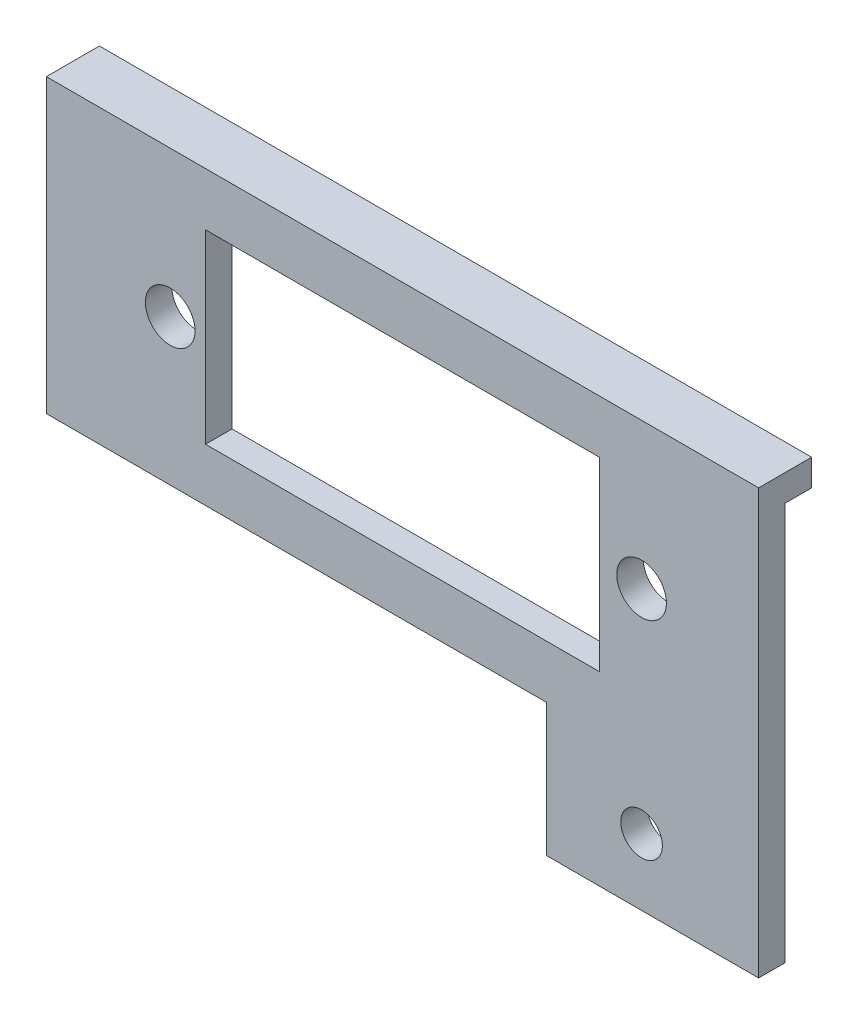
ISO-10303-21;
HEADER;
FILE_DESCRIPTION(('STEP AP214'),'2;1');
FILE_NAME('part.step','',(''),(''),'','','');
FILE_SCHEMA(('AUTOMOTIVE_DESIGN { 1 0 10303 214 1 1 1 1 }'));
ENDSEC;
DATA;
#1=APPLICATION_CONTEXT('core data for automotive mechanical design processes');
#2=APPLICATION_PROTOCOL_DEFINITION('international standard','automotive_design',2000,#1);
#3=PRODUCT_CONTEXT('',#1,'mechanical');
#4=PRODUCT('Part','Part','',(#3));
#5=PRODUCT_RELATED_PRODUCT_CATEGORY('part','',(#4));
#6=PRODUCT_DEFINITION_FORMATION('','',#4);
#7=PRODUCT_DEFINITION_CONTEXT('part definition',#1,'design');
#8=PRODUCT_DEFINITION('design','',#6,#7);
#9=PRODUCT_DEFINITION_SHAPE('','',#8);
#10=(LENGTH_UNIT() NAMED_UNIT(*) SI_UNIT(.MILLI.,.METRE.));
#11=(NAMED_UNIT(*) PLANE_ANGLE_UNIT() SI_UNIT($,.RADIAN.));
#12=(NAMED_UNIT(*) SI_UNIT($,.STERADIAN.) SOLID_ANGLE_UNIT());
#13=UNCERTAINTY_MEASURE_WITH_UNIT(LENGTH_MEASURE(1.E-05),#10,'distance_accuracy_value','');
#14=(GEOMETRIC_REPRESENTATION_CONTEXT(3) GLOBAL_UNCERTAINTY_ASSIGNED_CONTEXT((#13)) GLOBAL_UNIT_ASSIGNED_CONTEXT((#10,
#11,#12)) REPRESENTATION_CONTEXT('',''));
#15=CARTESIAN_POINT('',(0.,0.,0.));
#16=DIRECTION('',(0.,0.,1.));
#17=DIRECTION('',(1.,0.,0.));
#18=AXIS2_PLACEMENT_3D('',#15,#16,#17);
#19=CARTESIAN_POINT('',(0.,0.,0.));
#20=DIRECTION('',(0.,0.,1.));
#21=DIRECTION('',(1.,0.,0.));
#22=AXIS2_PLACEMENT_3D('',#19,#20,#21);
#23=PLANE('',#22);
#24=CARTESIAN_POINT('',(23.4715819172548,-33.3248,0.));
#25=DIRECTION('',(0.,0.,1.));
#26=DIRECTION('',(1.,0.,0.));
#27=AXIS2_PLACEMENT_3D('',#24,#25,#26);
#28=CIRCLE('',#27,2.4892);
#29=CARTESIAN_POINT('',(25.9607819172548,-33.3248,0.));
#30=VERTEX_POINT('',#29);
#31=EDGE_CURVE('E185',#30,#30,#28,.T.);
#32=ORIENTED_EDGE('',*,*,#31,.T.);
#33=EDGE_LOOP('',(#32));
#34=FACE_BOUND('',#33,.T.);
#35=DIRECTION('',(0.,-1.,0.));
#36=VECTOR('',#35,1.);
#37=CARTESIAN_POINT('',(-28.7146999999993,0.,0.));
#38=LINE('',#37,#36);
#39=CARTESIAN_POINT('',(-28.7146999999993,3.1877,0.));
#40=VERTEX_POINT('',#39);
#41=CARTESIAN_POINT('',(-28.7146999999993,-19.0373,0.));
#42=VERTEX_POINT('',#41);
#43=EDGE_CURVE('E177',#40,#42,#38,.T.);
#44=ORIENTED_EDGE('',*,*,#43,.T.);
#45=DIRECTION('',(-1.,0.,0.));
#46=VECTOR('',#45,1.);
#47=CARTESIAN_POINT('',(0.,-19.0373,0.));
#48=LINE('',#47,#46);
#49=CARTESIAN_POINT('',(18.4276999999991,-19.0373,0.));
#50=VERTEX_POINT('',#49);
#51=EDGE_CURVE('E183',#50,#42,#48,.T.);
#52=ORIENTED_EDGE('',*,*,#51,.F.);
#53=DIRECTION('',(0.,-1.,0.));
#54=VECTOR('',#53,1.);
#55=CARTESIAN_POINT('',(18.4276999999991,0.,0.));
#56=LINE('',#55,#54);
#57=CARTESIAN_POINT('',(18.4276999999991,3.1877,0.));
#58=VERTEX_POINT('',#57);
#59=EDGE_CURVE('E181',#58,#50,#56,.T.);
#60=ORIENTED_EDGE('',*,*,#59,.F.);
#61=DIRECTION('',(-1.,0.,0.));
#62=VECTOR('',#61,1.);
#63=CARTESIAN_POINT('',(0.,3.1877,0.));
#64=LINE('',#63,#62);
#65=EDGE_CURVE('E133',#58,#40,#64,.T.);
#66=ORIENTED_EDGE('',*,*,#65,.T.);
#67=EDGE_LOOP('',(#44,#52,#60,#66));
#68=FACE_BOUND('',#67,.T.);
#69=CARTESIAN_POINT('',(23.4715819172548,-7.9248,0.));
#70=DIRECTION('',(0.,0.,1.));
#71=DIRECTION('',(1.,0.,0.));
#72=AXIS2_PLACEMENT_3D('',#69,#70,#71);
#73=CIRCLE('',#72,2.9718);
#74=CARTESIAN_POINT('',(26.4433819172548,-7.9248,0.));
#75=VERTEX_POINT('',#74);
#76=EDGE_CURVE('E160',#75,#75,#73,.T.);
#77=ORIENTED_EDGE('',*,*,#76,.T.);
#78=EDGE_LOOP('',(#77));
#79=FACE_BOUND('',#78,.T.);
#80=CARTESIAN_POINT('',(-32.9418180827452,-7.9248,0.));
#81=DIRECTION('',(0.,0.,1.));
#82=DIRECTION('',(1.,0.,0.));
#83=AXIS2_PLACEMENT_3D('',#80,#81,#82);
#84=CIRCLE('',#83,2.9718);
#85=CARTESIAN_POINT('',(-29.9700180827452,-7.9248,0.));
#86=VERTEX_POINT('',#85);
#87=EDGE_CURVE('E157',#86,#86,#84,.T.);
#88=ORIENTED_EDGE('',*,*,#87,.T.);
#89=EDGE_LOOP('',(#88));
#90=FACE_BOUND('',#89,.T.);
#91=DIRECTION('',(-1.,0.,0.));
#92=VECTOR('',#91,1.);
#93=CARTESIAN_POINT('',(37.4776999999991,6.3627,0.));
#94=LINE('',#93,#92);
#95=CARTESIAN_POINT('',(37.4776999999991,6.3627,0.));
#96=VERTEX_POINT('',#95);
#97=CARTESIAN_POINT('',(-47.7646999999993,6.3627,0.));
#98=VERTEX_POINT('',#97);
#99=EDGE_CURVE('E55',#96,#98,#94,.T.);
#100=ORIENTED_EDGE('',*,*,#99,.F.);
#101=DIRECTION('',(0.,-1.,0.));
#102=VECTOR('',#101,1.);
#103=CARTESIAN_POINT('',(37.4776999999991,0.,0.));
#104=LINE('',#103,#102);
#105=CARTESIAN_POINT('',(37.4776999999991,-41.2623,0.));
#106=VERTEX_POINT('',#105);
#107=EDGE_CURVE('E173',#96,#106,#104,.T.);
#108=ORIENTED_EDGE('',*,*,#107,.T.);
#109=DIRECTION('',(-1.,0.,0.));
#110=VECTOR('',#109,1.);
#111=CARTESIAN_POINT('',(0.,-41.2623,0.));
#112=LINE('',#111,#110);
#113=CARTESIAN_POINT('',(12.0776999999991,-41.2623,0.));
#114=VERTEX_POINT('',#113);
#115=EDGE_CURVE('E170',#106,#114,#112,.T.);
#116=ORIENTED_EDGE('',*,*,#115,.T.);
#117=DIRECTION('',(0.,-1.,0.));
#118=VECTOR('',#117,1.);
#119=CARTESIAN_POINT('',(12.0776999999991,0.,0.));
#120=LINE('',#119,#118);
#121=CARTESIAN_POINT('',(12.0776999999991,-25.3873,0.));
#122=VERTEX_POINT('',#121);
#123=EDGE_CURVE('E167',#122,#114,#120,.T.);
#124=ORIENTED_EDGE('',*,*,#123,.F.);
#125=DIRECTION('',(-1.,0.,0.));
#126=VECTOR('',#125,1.);
#127=CARTESIAN_POINT('',(0.,-25.3873,0.));
#128=LINE('',#127,#126);
#129=CARTESIAN_POINT('',(-47.7646999999993,-25.3873,0.));
#130=VERTEX_POINT('',#129);
#131=EDGE_CURVE('E164',#122,#130,#128,.T.);
#132=ORIENTED_EDGE('',*,*,#131,.T.);
#133=DIRECTION('',(0.,-1.,0.));
#134=VECTOR('',#133,1.);
#135=CARTESIAN_POINT('',(-47.7646999999993,0.,0.));
#136=LINE('',#135,#134);
#137=EDGE_CURVE('E175',#98,#130,#136,.T.);
#138=ORIENTED_EDGE('',*,*,#137,.F.);
#139=EDGE_LOOP('',(#100,#108,#116,#124,#132,#138));
#140=FACE_BOUND('',#139,.T.);
#141=ADVANCED_FACE('F38',(#34,#68,#79,#90,#140),#23,.F.);
#142=CARTESIAN_POINT('',(-28.7146999999993,0.,3.175));
#143=DIRECTION('',(1.,0.,0.));
#144=DIRECTION('',(0.,1.,0.));
#145=AXIS2_PLACEMENT_3D('',#142,#143,#144);
#146=PLANE('',#145);
#147=ORIENTED_EDGE('',*,*,#43,.F.);
#148=DIRECTION('',(0.,0.,-1.));
#149=VECTOR('',#148,1.);
#150=CARTESIAN_POINT('',(-28.7146999999993,3.1877,3.175));
#151=LINE('',#150,#149);
#152=CARTESIAN_POINT('',(-28.7146999999993,3.1877,3.175));
#153=VERTEX_POINT('',#152);
#154=EDGE_CURVE('E11',#153,#40,#151,.T.);
#155=ORIENTED_EDGE('',*,*,#154,.F.);
#156=DIRECTION('',(0.,-1.,0.));
#157=VECTOR('',#156,1.);
#158=CARTESIAN_POINT('',(-28.7146999999993,0.,3.175));
#159=LINE('',#158,#157);
#160=CARTESIAN_POINT('',(-28.7146999999993,-19.0373,3.175));
#161=VERTEX_POINT('',#160);
#162=EDGE_CURVE('E146',#153,#161,#159,.T.);
#163=ORIENTED_EDGE('',*,*,#162,.T.);
#164=DIRECTION('',(0.,0.,-1.));
#165=VECTOR('',#164,1.);
#166=CARTESIAN_POINT('',(-28.7146999999993,-19.0373,3.175));
#167=LINE('',#166,#165);
#168=EDGE_CURVE('E95',#161,#42,#167,.T.);
#169=ORIENTED_EDGE('',*,*,#168,.T.);
#170=EDGE_LOOP('',(#147,#155,#163,#169));
#171=FACE_BOUND('',#170,.T.);
#172=ADVANCED_FACE('F284',(#171),#146,.T.);
#173=CARTESIAN_POINT('',(0.,3.1877,3.175));
#174=DIRECTION('',(0.,-1.,0.));
#175=DIRECTION('',(1.,0.,0.));
#176=AXIS2_PLACEMENT_3D('',#173,#174,#175);
#177=PLANE('',#176);
#178=ORIENTED_EDGE('',*,*,#65,.F.);
#179=DIRECTION('',(0.,0.,-1.));
#180=VECTOR('',#179,1.);
#181=CARTESIAN_POINT('',(18.4276999999991,3.1877,3.175));
#182=LINE('',#181,#180);
#183=CARTESIAN_POINT('',(18.4276999999991,3.1877,3.175));
#184=VERTEX_POINT('',#183);
#185=EDGE_CURVE('E47',#184,#58,#182,.T.);
#186=ORIENTED_EDGE('',*,*,#185,.F.);
#187=DIRECTION('',(-1.,0.,0.));
#188=VECTOR('',#187,1.);
#189=CARTESIAN_POINT('',(0.,3.1877,3.175));
#190=LINE('',#189,#188);
#191=EDGE_CURVE('E131',#184,#153,#190,.T.);
#192=ORIENTED_EDGE('',*,*,#191,.T.);
#193=ORIENTED_EDGE('',*,*,#154,.T.);
#194=EDGE_LOOP('',(#178,#186,#192,#193));
#195=FACE_BOUND('',#194,.T.);
#196=ADVANCED_FACE('F129',(#195),#177,.T.);
#197=CARTESIAN_POINT('',(18.4276999999991,0.,3.175));
#198=DIRECTION('',(1.,0.,0.));
#199=DIRECTION('',(0.,1.,0.));
#200=AXIS2_PLACEMENT_3D('',#197,#198,#199);
#201=PLANE('',#200);
#202=ORIENTED_EDGE('',*,*,#59,.T.);
#203=DIRECTION('',(0.,0.,-1.));
#204=VECTOR('',#203,1.);
#205=CARTESIAN_POINT('',(18.4276999999991,-19.0373,3.175));
#206=LINE('',#205,#204);
#207=CARTESIAN_POINT('',(18.4276999999991,-19.0373,3.175));
#208=VERTEX_POINT('',#207);
#209=EDGE_CURVE('E137',#208,#50,#206,.T.);
#210=ORIENTED_EDGE('',*,*,#209,.F.);
#211=DIRECTION('',(0.,-1.,0.));
#212=VECTOR('',#211,1.);
#213=CARTESIAN_POINT('',(18.4276999999991,0.,3.175));
#214=LINE('',#213,#212);
#215=EDGE_CURVE('E140',#184,#208,#214,.T.);
#216=ORIENTED_EDGE('',*,*,#215,.F.);
#217=ORIENTED_EDGE('',*,*,#185,.T.);
#218=EDGE_LOOP('',(#202,#210,#216,#217));
#219=FACE_BOUND('',#218,.T.);
#220=ADVANCED_FACE('F141',(#219),#201,.F.);
#221=CARTESIAN_POINT('',(0.,-25.3873,3.175));
#222=DIRECTION('',(0.,-1.,0.));
#223=DIRECTION('',(1.,0.,0.));
#224=AXIS2_PLACEMENT_3D('',#221,#222,#223);
#225=PLANE('',#224);
#226=ORIENTED_EDGE('',*,*,#131,.F.);
#227=DIRECTION('',(0.,0.,-1.));
#228=VECTOR('',#227,1.);
#229=CARTESIAN_POINT('',(12.0776999999991,-25.3873,3.175));
#230=LINE('',#229,#228);
#231=CARTESIAN_POINT('',(12.0776999999991,-25.3873,3.175));
#232=VERTEX_POINT('',#231);
#233=EDGE_CURVE('E42',#232,#122,#230,.T.);
#234=ORIENTED_EDGE('',*,*,#233,.F.);
#235=DIRECTION('',(-1.,0.,0.));
#236=VECTOR('',#235,1.);
#237=CARTESIAN_POINT('',(0.,-25.3873,3.175));
#238=LINE('',#237,#236);
#239=CARTESIAN_POINT('',(-47.7646999999993,-25.3873,3.175));
#240=VERTEX_POINT('',#239);
#241=EDGE_CURVE('E213',#232,#240,#238,.T.);
#242=ORIENTED_EDGE('',*,*,#241,.T.);
#243=DIRECTION('',(0.,0.,-1.));
#244=VECTOR('',#243,1.);
#245=CARTESIAN_POINT('',(-47.7646999999993,-25.3873,3.175));
#246=LINE('',#245,#244);
#247=EDGE_CURVE('E156',#240,#130,#246,.T.);
#248=ORIENTED_EDGE('',*,*,#247,.T.);
#249=EDGE_LOOP('',(#226,#234,#242,#248));
#250=FACE_BOUND('',#249,.T.);
#251=ADVANCED_FACE('F211',(#250),#225,.T.);
#252=CARTESIAN_POINT('',(12.0776999999991,0.,3.175));
#253=DIRECTION('',(1.,0.,0.));
#254=DIRECTION('',(0.,1.,0.));
#255=AXIS2_PLACEMENT_3D('',#252,#253,#254);
#256=PLANE('',#255);
#257=ORIENTED_EDGE('',*,*,#123,.T.);
#258=DIRECTION('',(0.,0.,-1.));
#259=VECTOR('',#258,1.);
#260=CARTESIAN_POINT('',(12.0776999999991,-41.2623,3.175));
#261=LINE('',#260,#259);
#262=CARTESIAN_POINT('',(12.0776999999991,-41.2623,3.175));
#263=VERTEX_POINT('',#262);
#264=EDGE_CURVE('E201',#263,#114,#261,.T.);
#265=ORIENTED_EDGE('',*,*,#264,.F.);
#266=DIRECTION('',(0.,-1.,0.));
#267=VECTOR('',#266,1.);
#268=CARTESIAN_POINT('',(12.0776999999991,0.,3.175));
#269=LINE('',#268,#267);
#270=EDGE_CURVE('E209',#232,#263,#269,.T.);
#271=ORIENTED_EDGE('',*,*,#270,.F.);
#272=ORIENTED_EDGE('',*,*,#233,.T.);
#273=EDGE_LOOP('',(#257,#265,#271,#272));
#274=FACE_BOUND('',#273,.T.);
#275=ADVANCED_FACE('F208',(#274),#256,.F.);
#276=CARTESIAN_POINT('',(0.,-41.2623,3.175));
#277=DIRECTION('',(0.,-1.,0.));
#278=DIRECTION('',(1.,0.,0.));
#279=AXIS2_PLACEMENT_3D('',#276,#277,#278);
#280=PLANE('',#279);
#281=ORIENTED_EDGE('',*,*,#115,.F.);
#282=DIRECTION('',(0.,0.,-1.));
#283=VECTOR('',#282,1.);
#284=CARTESIAN_POINT('',(37.4776999999991,-41.2623,3.175));
#285=LINE('',#284,#283);
#286=CARTESIAN_POINT('',(37.4776999999991,-41.2623,3.175));
#287=VERTEX_POINT('',#286);
#288=EDGE_CURVE('E199',#287,#106,#285,.T.);
#289=ORIENTED_EDGE('',*,*,#288,.F.);
#290=DIRECTION('',(-1.,0.,0.));
#291=VECTOR('',#290,1.);
#292=CARTESIAN_POINT('',(0.,-41.2623,3.175));
#293=LINE('',#292,#291);
#294=EDGE_CURVE('E247',#287,#263,#293,.T.);
#295=ORIENTED_EDGE('',*,*,#294,.T.);
#296=ORIENTED_EDGE('',*,*,#264,.T.);
#297=EDGE_LOOP('',(#281,#289,#295,#296));
#298=FACE_BOUND('',#297,.T.);
#299=ADVANCED_FACE('F274',(#298),#280,.T.);
#300=CARTESIAN_POINT('',(37.4776999999991,0.,3.175));
#301=DIRECTION('',(1.,0.,0.));
#302=DIRECTION('',(0.,1.,0.));
#303=AXIS2_PLACEMENT_3D('',#300,#301,#302);
#304=PLANE('',#303);
#305=ORIENTED_EDGE('',*,*,#107,.F.);
#306=DIRECTION('',(0.,0.,1.));
#307=VECTOR('',#306,1.);
#308=CARTESIAN_POINT('',(37.4776999999991,6.3627,-3.175));
#309=LINE('',#308,#307);
#310=CARTESIAN_POINT('',(37.4776999999991,6.3627,-3.175));
#311=VERTEX_POINT('',#310);
#312=EDGE_CURVE('E161',#311,#96,#309,.T.);
#313=ORIENTED_EDGE('',*,*,#312,.F.);
#314=DIRECTION('',(0.,-1.,0.));
#315=VECTOR('',#314,1.);
#316=CARTESIAN_POINT('',(37.4776999999991,9.5377,-3.175));
#317=LINE('',#316,#315);
#318=CARTESIAN_POINT('',(37.4776999999991,9.5377,-3.175));
#319=VERTEX_POINT('',#318);
#320=EDGE_CURVE('E229',#319,#311,#317,.T.);
#321=ORIENTED_EDGE('',*,*,#320,.F.);
#322=DIRECTION('',(0.,0.,-1.));
#323=VECTOR('',#322,1.);
#324=CARTESIAN_POINT('',(37.4776999999991,9.5377,3.175));
#325=LINE('',#324,#323);
#326=CARTESIAN_POINT('',(37.4776999999991,9.5377,3.175));
#327=VERTEX_POINT('',#326);
#328=EDGE_CURVE('E196',#327,#319,#325,.T.);
#329=ORIENTED_EDGE('',*,*,#328,.F.);
#330=DIRECTION('',(0.,-1.,0.));
#331=VECTOR('',#330,1.);
#332=CARTESIAN_POINT('',(37.4776999999991,0.,3.175));
#333=LINE('',#332,#331);
#334=EDGE_CURVE('E249',#327,#287,#333,.T.);
#335=ORIENTED_EDGE('',*,*,#334,.T.);
#336=ORIENTED_EDGE('',*,*,#288,.T.);
#337=EDGE_LOOP('',(#305,#313,#321,#329,#335,#336));
#338=FACE_BOUND('',#337,.T.);
#339=ADVANCED_FACE('F273',(#338),#304,.T.);
#340=CARTESIAN_POINT('',(0.,9.5377,3.175));
#341=DIRECTION('',(0.,1.,0.));
#342=DIRECTION('',(0.,0.,1.));
#343=AXIS2_PLACEMENT_3D('',#340,#341,#342);
#344=PLANE('',#343);
#345=ORIENTED_EDGE('',*,*,#328,.T.);
#346=DIRECTION('',(1.,0.,0.));
#347=VECTOR('',#346,1.);
#348=CARTESIAN_POINT('',(37.4776999999991,9.5377,-3.175));
#349=LINE('',#348,#347);
#350=CARTESIAN_POINT('',(-47.7646999999993,9.5377,-3.175));
#351=VERTEX_POINT('',#350);
#352=EDGE_CURVE('E236',#351,#319,#349,.T.);
#353=ORIENTED_EDGE('',*,*,#352,.F.);
#354=DIRECTION('',(0.,0.,-1.));
#355=VECTOR('',#354,1.);
#356=CARTESIAN_POINT('',(-47.7646999999993,9.5377,3.175));
#357=LINE('',#356,#355);
#358=CARTESIAN_POINT('',(-47.7646999999993,9.5377,3.175));
#359=VERTEX_POINT('',#358);
#360=EDGE_CURVE('E193',#359,#351,#357,.T.);
#361=ORIENTED_EDGE('',*,*,#360,.F.);
#362=DIRECTION('',(1.,0.,0.));
#363=VECTOR('',#362,1.);
#364=CARTESIAN_POINT('',(0.,9.5377,3.175));
#365=LINE('',#364,#363);
#366=EDGE_CURVE('E252',#359,#327,#365,.T.);
#367=ORIENTED_EDGE('',*,*,#366,.T.);
#368=EDGE_LOOP('',(#345,#353,#361,#367));
#369=FACE_BOUND('',#368,.T.);
#370=ADVANCED_FACE('F258',(#369),#344,.T.);
#371=CARTESIAN_POINT('',(0.,-19.0373,3.175));
#372=DIRECTION('',(0.,-1.,0.));
#373=DIRECTION('',(1.,0.,0.));
#374=AXIS2_PLACEMENT_3D('',#371,#372,#373);
#375=PLANE('',#374);
#376=ORIENTED_EDGE('',*,*,#51,.T.);
#377=ORIENTED_EDGE('',*,*,#168,.F.);
#378=DIRECTION('',(-1.,0.,0.));
#379=VECTOR('',#378,1.);
#380=CARTESIAN_POINT('',(0.,-19.0373,3.175));
#381=LINE('',#380,#379);
#382=EDGE_CURVE('E64',#208,#161,#381,.T.);
#383=ORIENTED_EDGE('',*,*,#382,.F.);
#384=ORIENTED_EDGE('',*,*,#209,.T.);
#385=EDGE_LOOP('',(#376,#377,#383,#384));
#386=FACE_BOUND('',#385,.T.);
#387=ADVANCED_FACE('F299',(#386),#375,.F.);
#388=CARTESIAN_POINT('',(-47.7646999999993,0.,3.175));
#389=DIRECTION('',(1.,0.,0.));
#390=DIRECTION('',(0.,0.,-1.));
#391=AXIS2_PLACEMENT_3D('',#388,#389,#390);
#392=PLANE('',#391);
#393=ORIENTED_EDGE('',*,*,#360,.T.);
#394=DIRECTION('',(0.,1.,0.));
#395=VECTOR('',#394,1.);
#396=CARTESIAN_POINT('',(-47.7646999999993,9.5377,-3.175));
#397=LINE('',#396,#395);
#398=CARTESIAN_POINT('',(-47.7646999999993,6.3627,-3.175));
#399=VERTEX_POINT('',#398);
#400=EDGE_CURVE('E263',#399,#351,#397,.T.);
#401=ORIENTED_EDGE('',*,*,#400,.F.);
#402=DIRECTION('',(0.,0.,1.));
#403=VECTOR('',#402,1.);
#404=CARTESIAN_POINT('',(-47.7646999999993,6.3627,-3.175));
#405=LINE('',#404,#403);
#406=EDGE_CURVE('E221',#399,#98,#405,.T.);
#407=ORIENTED_EDGE('',*,*,#406,.T.);
#408=ORIENTED_EDGE('',*,*,#137,.T.);
#409=ORIENTED_EDGE('',*,*,#247,.F.);
#410=DIRECTION('',(0.,-1.,0.));
#411=VECTOR('',#410,1.);
#412=CARTESIAN_POINT('',(-47.7646999999993,0.,3.175));
#413=LINE('',#412,#411);
#414=EDGE_CURVE('E148',#359,#240,#413,.T.);
#415=ORIENTED_EDGE('',*,*,#414,.F.);
#416=EDGE_LOOP('',(#393,#401,#407,#408,#409,#415));
#417=FACE_BOUND('',#416,.T.);
#418=ADVANCED_FACE('F216',(#417),#392,.F.);
#419=CARTESIAN_POINT('',(23.4715819172548,-7.9248,3.175));
#420=DIRECTION('',(0.,0.,-1.));
#421=DIRECTION('',(-1.,0.,0.));
#422=AXIS2_PLACEMENT_3D('',#419,#420,#421);
#423=CYLINDRICAL_SURFACE('',#422,2.9718);
#424=CARTESIAN_POINT('',(23.4715819172548,-7.9248,3.175));
#425=DIRECTION('',(0.,0.,1.));
#426=DIRECTION('',(1.,0.,0.));
#427=AXIS2_PLACEMENT_3D('',#424,#425,#426);
#428=CIRCLE('',#427,2.9718);
#429=CARTESIAN_POINT('',(26.4433819172548,-7.9248,3.175));
#430=VERTEX_POINT('',#429);
#431=EDGE_CURVE('E242',#430,#430,#428,.T.);
#432=ORIENTED_EDGE('',*,*,#431,.T.);
#433=EDGE_LOOP('',(#432));
#434=FACE_BOUND('',#433,.T.);
#435=ORIENTED_EDGE('',*,*,#76,.F.);
#436=EDGE_LOOP('',(#435));
#437=FACE_BOUND('',#436,.T.);
#438=ADVANCED_FACE('F309',(#434,#437),#423,.F.);
#439=CARTESIAN_POINT('',(-32.9418180827452,-7.9248,3.175));
#440=DIRECTION('',(0.,0.,-1.));
#441=DIRECTION('',(-1.,0.,0.));
#442=AXIS2_PLACEMENT_3D('',#439,#440,#441);
#443=CYLINDRICAL_SURFACE('',#442,2.9718);
#444=CARTESIAN_POINT('',(-32.9418180827452,-7.9248,3.175));
#445=DIRECTION('',(0.,0.,1.));
#446=DIRECTION('',(1.,0.,0.));
#447=AXIS2_PLACEMENT_3D('',#444,#445,#446);
#448=CIRCLE('',#447,2.9718);
#449=CARTESIAN_POINT('',(-29.9700180827452,-7.9248,3.175));
#450=VERTEX_POINT('',#449);
#451=EDGE_CURVE('E188',#450,#450,#448,.T.);
#452=ORIENTED_EDGE('',*,*,#451,.T.);
#453=EDGE_LOOP('',(#452));
#454=FACE_BOUND('',#453,.T.);
#455=ORIENTED_EDGE('',*,*,#87,.F.);
#456=EDGE_LOOP('',(#455));
#457=FACE_BOUND('',#456,.T.);
#458=ADVANCED_FACE('F40',(#454,#457),#443,.F.);
#459=CARTESIAN_POINT('',(23.4715819172548,-33.3248,3.175));
#460=DIRECTION('',(0.,0.,-1.));
#461=DIRECTION('',(-1.,0.,0.));
#462=AXIS2_PLACEMENT_3D('',#459,#460,#461);
#463=CYLINDRICAL_SURFACE('',#462,2.4892);
#464=CARTESIAN_POINT('',(23.4715819172548,-33.3248,3.175));
#465=DIRECTION('',(0.,0.,1.));
#466=DIRECTION('',(1.,0.,0.));
#467=AXIS2_PLACEMENT_3D('',#464,#465,#466);
#468=CIRCLE('',#467,2.4892);
#469=CARTESIAN_POINT('',(25.9607819172548,-33.3248,3.175));
#470=VERTEX_POINT('',#469);
#471=EDGE_CURVE('E153',#470,#470,#468,.T.);
#472=ORIENTED_EDGE('',*,*,#471,.T.);
#473=EDGE_LOOP('',(#472));
#474=FACE_BOUND('',#473,.T.);
#475=ORIENTED_EDGE('',*,*,#31,.F.);
#476=EDGE_LOOP('',(#475));
#477=FACE_BOUND('',#476,.T.);
#478=ADVANCED_FACE('F295',(#474,#477),#463,.F.);
#479=CARTESIAN_POINT('',(0.,0.,3.175));
#480=DIRECTION('',(0.,0.,1.));
#481=DIRECTION('',(1.,0.,0.));
#482=AXIS2_PLACEMENT_3D('',#479,#480,#481);
#483=PLANE('',#482);
#484=ORIENTED_EDGE('',*,*,#451,.F.);
#485=EDGE_LOOP('',(#484));
#486=FACE_BOUND('',#485,.T.);
#487=ORIENTED_EDGE('',*,*,#431,.F.);
#488=EDGE_LOOP('',(#487));
#489=FACE_BOUND('',#488,.T.);
#490=ORIENTED_EDGE('',*,*,#241,.F.);
#491=ORIENTED_EDGE('',*,*,#270,.T.);
#492=ORIENTED_EDGE('',*,*,#294,.F.);
#493=ORIENTED_EDGE('',*,*,#334,.F.);
#494=ORIENTED_EDGE('',*,*,#366,.F.);
#495=ORIENTED_EDGE('',*,*,#414,.T.);
#496=EDGE_LOOP('',(#490,#491,#492,#493,#494,#495));
#497=FACE_BOUND('',#496,.T.);
#498=ORIENTED_EDGE('',*,*,#162,.F.);
#499=ORIENTED_EDGE('',*,*,#191,.F.);
#500=ORIENTED_EDGE('',*,*,#215,.T.);
#501=ORIENTED_EDGE('',*,*,#382,.T.);
#502=EDGE_LOOP('',(#498,#499,#500,#501));
#503=FACE_BOUND('',#502,.T.);
#504=ORIENTED_EDGE('',*,*,#471,.F.);
#505=EDGE_LOOP('',(#504));
#506=FACE_BOUND('',#505,.T.);
#507=ADVANCED_FACE('F144',(#486,#489,#497,#503,#506),#483,.T.);
#508=CARTESIAN_POINT('',(37.4776999999991,6.3627,-3.175));
#509=DIRECTION('',(0.,1.,0.));
#510=DIRECTION('',(0.,0.,1.));
#511=AXIS2_PLACEMENT_3D('',#508,#509,#510);
#512=PLANE('',#511);
#513=ORIENTED_EDGE('',*,*,#99,.T.);
#514=ORIENTED_EDGE('',*,*,#406,.F.);
#515=DIRECTION('',(-1.,0.,0.));
#516=VECTOR('',#515,1.);
#517=CARTESIAN_POINT('',(37.4776999999991,6.3627,-3.175));
#518=LINE('',#517,#516);
#519=EDGE_CURVE('E232',#311,#399,#518,.T.);
#520=ORIENTED_EDGE('',*,*,#519,.F.);
#521=ORIENTED_EDGE('',*,*,#312,.T.);
#522=EDGE_LOOP('',(#513,#514,#520,#521));
#523=FACE_BOUND('',#522,.T.);
#524=ADVANCED_FACE('F225',(#523),#512,.F.);
#525=CARTESIAN_POINT('',(0.,0.,-3.175));
#526=DIRECTION('',(0.,0.,-1.));
#527=DIRECTION('',(-1.,0.,0.));
#528=AXIS2_PLACEMENT_3D('',#525,#526,#527);
#529=PLANE('',#528);
#530=ORIENTED_EDGE('',*,*,#320,.T.);
#531=ORIENTED_EDGE('',*,*,#519,.T.);
#532=ORIENTED_EDGE('',*,*,#400,.T.);
#533=ORIENTED_EDGE('',*,*,#352,.T.);
#534=EDGE_LOOP('',(#530,#531,#532,#533));
#535=FACE_BOUND('',#534,.T.);
#536=ADVANCED_FACE('F267',(#535),#529,.T.);
#537=CLOSED_SHELL('',(#141,#172,#196,#220,#251,#275,#299,#339,#370,#387,#418,#438,#458,#478,
#507,#524,#536));
#538=MANIFOLD_SOLID_BREP('B2',#537);
#539=ADVANCED_BREP_SHAPE_REPRESENTATION('',(#18,#538),#14);
#540=SHAPE_DEFINITION_REPRESENTATION(#9,#539);
ENDSEC;
END-ISO-10303-21;
